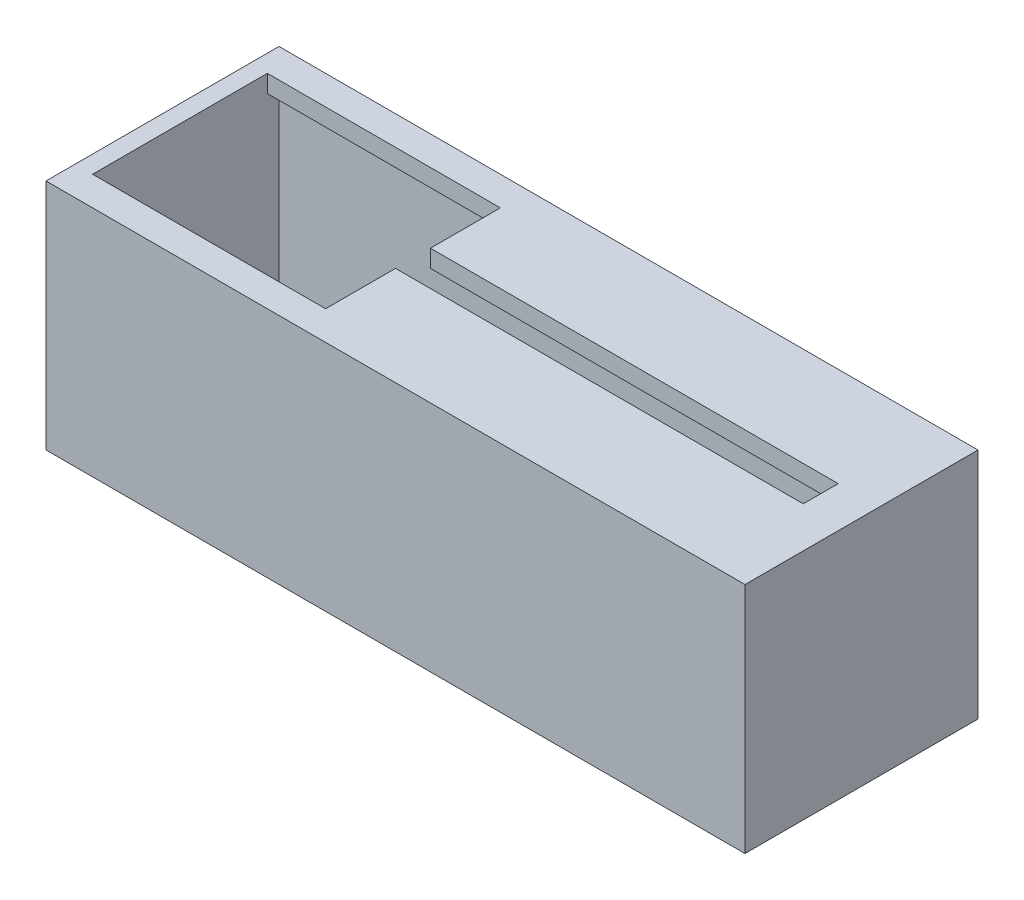
ISO-10303-21;
HEADER;
FILE_DESCRIPTION(('STEP AP214'),'2;1');
FILE_NAME('part.step','',(''),(''),'','','');
FILE_SCHEMA(('AUTOMOTIVE_DESIGN { 1 0 10303 214 1 1 1 1 }'));
ENDSEC;
DATA;
#1=APPLICATION_CONTEXT('core data for automotive mechanical design processes');
#2=APPLICATION_PROTOCOL_DEFINITION('international standard','automotive_design',2000,#1);
#3=PRODUCT_CONTEXT('',#1,'mechanical');
#4=PRODUCT('Part','Part','',(#3));
#5=PRODUCT_RELATED_PRODUCT_CATEGORY('part','',(#4));
#6=PRODUCT_DEFINITION_FORMATION('','',#4);
#7=PRODUCT_DEFINITION_CONTEXT('part definition',#1,'design');
#8=PRODUCT_DEFINITION('design','',#6,#7);
#9=PRODUCT_DEFINITION_SHAPE('','',#8);
#10=(LENGTH_UNIT() NAMED_UNIT(*) SI_UNIT(.MILLI.,.METRE.));
#11=(NAMED_UNIT(*) PLANE_ANGLE_UNIT() SI_UNIT($,.RADIAN.));
#12=(NAMED_UNIT(*) SI_UNIT($,.STERADIAN.) SOLID_ANGLE_UNIT());
#13=UNCERTAINTY_MEASURE_WITH_UNIT(LENGTH_MEASURE(1.E-05),#10,'distance_accuracy_value','');
#14=(GEOMETRIC_REPRESENTATION_CONTEXT(3) GLOBAL_UNCERTAINTY_ASSIGNED_CONTEXT((#13)) GLOBAL_UNIT_ASSIGNED_CONTEXT((#10,
#11,#12)) REPRESENTATION_CONTEXT('',''));
#15=CARTESIAN_POINT('',(0.,0.,0.));
#16=DIRECTION('',(0.,0.,1.));
#17=DIRECTION('',(1.,0.,0.));
#18=AXIS2_PLACEMENT_3D('',#15,#16,#17);
#19=CARTESIAN_POINT('',(1.5,20.,0.));
#20=DIRECTION('',(1.,0.,0.));
#21=DIRECTION('',(0.,0.,-1.));
#22=AXIS2_PLACEMENT_3D('',#19,#20,#21);
#23=PLANE('',#22);
#24=DIRECTION('',(0.,0.,1.));
#25=VECTOR('',#24,1.);
#26=CARTESIAN_POINT('',(1.5,18.5,0.));
#27=LINE('',#26,#25);
#28=CARTESIAN_POINT('',(1.5,18.5,1.5));
#29=VERTEX_POINT('',#28);
#30=CARTESIAN_POINT('',(1.5,18.5,2.5));
#31=VERTEX_POINT('',#30);
#32=EDGE_CURVE('E270',#29,#31,#27,.T.);
#33=ORIENTED_EDGE('',*,*,#32,.T.);
#34=DIRECTION('',(0.,1.,0.));
#35=VECTOR('',#34,1.);
#36=CARTESIAN_POINT('',(1.5,1.99999999999999,2.5));
#37=LINE('',#36,#35);
#38=CARTESIAN_POINT('',(1.5,20.,2.5));
#39=VERTEX_POINT('',#38);
#40=EDGE_CURVE('E198',#31,#39,#37,.T.);
#41=ORIENTED_EDGE('',*,*,#40,.T.);
#42=DIRECTION('',(0.,0.,1.));
#43=VECTOR('',#42,1.);
#44=CARTESIAN_POINT('',(1.5,20.,2.5));
#45=LINE('',#44,#43);
#46=CARTESIAN_POINT('',(1.5,20.,17.5));
#47=VERTEX_POINT('',#46);
#48=EDGE_CURVE('E55',#39,#47,#45,.T.);
#49=ORIENTED_EDGE('',*,*,#48,.T.);
#50=DIRECTION('',(0.,1.,0.));
#51=VECTOR('',#50,1.);
#52=CARTESIAN_POINT('',(1.5,1.99999999999999,17.5));
#53=LINE('',#52,#51);
#54=CARTESIAN_POINT('',(1.5,18.5,17.5));
#55=VERTEX_POINT('',#54);
#56=EDGE_CURVE('E163',#55,#47,#53,.T.);
#57=ORIENTED_EDGE('',*,*,#56,.F.);
#58=CARTESIAN_POINT('',(1.5,18.5,18.5));
#59=VERTEX_POINT('',#58);
#60=EDGE_CURVE('E274',#55,#59,#27,.T.);
#61=ORIENTED_EDGE('',*,*,#60,.T.);
#62=DIRECTION('',(0.,-1.,0.));
#63=VECTOR('',#62,1.);
#64=CARTESIAN_POINT('',(1.5,20.,18.5));
#65=LINE('',#64,#63);
#66=CARTESIAN_POINT('',(1.5,1.5,18.5));
#67=VERTEX_POINT('',#66);
#68=EDGE_CURVE('E289',#59,#67,#65,.T.);
#69=ORIENTED_EDGE('',*,*,#68,.T.);
#70=DIRECTION('',(0.,0.,1.));
#71=VECTOR('',#70,1.);
#72=CARTESIAN_POINT('',(1.5,1.5,0.));
#73=LINE('',#72,#71);
#74=CARTESIAN_POINT('',(1.5,1.5,1.5));
#75=VERTEX_POINT('',#74);
#76=EDGE_CURVE('E259',#75,#67,#73,.T.);
#77=ORIENTED_EDGE('',*,*,#76,.F.);
#78=DIRECTION('',(0.,-1.,0.));
#79=VECTOR('',#78,1.);
#80=CARTESIAN_POINT('',(1.5,20.,1.5));
#81=LINE('',#80,#79);
#82=EDGE_CURVE('E296',#29,#75,#81,.T.);
#83=ORIENTED_EDGE('',*,*,#82,.F.);
#84=EDGE_LOOP('',(#33,#41,#49,#57,#61,#69,#77,#83));
#85=FACE_BOUND('',#84,.T.);
#86=ADVANCED_FACE('F39',(#85),#23,.T.);
#87=CARTESIAN_POINT('',(0.,20.,18.5));
#88=DIRECTION('',(0.,0.,-1.));
#89=DIRECTION('',(-1.,0.,0.));
#90=AXIS2_PLACEMENT_3D('',#87,#88,#89);
#91=PLANE('',#90);
#92=DIRECTION('',(1.,0.,0.));
#93=VECTOR('',#92,1.);
#94=CARTESIAN_POINT('',(0.,1.5,18.5));
#95=LINE('',#94,#93);
#96=CARTESIAN_POINT('',(58.5,1.5,18.5));
#97=VERTEX_POINT('',#96);
#98=EDGE_CURVE('E293',#67,#97,#95,.T.);
#99=ORIENTED_EDGE('',*,*,#98,.F.);
#100=ORIENTED_EDGE('',*,*,#68,.F.);
#101=DIRECTION('',(1.,0.,0.));
#102=VECTOR('',#101,1.);
#103=CARTESIAN_POINT('',(0.,18.5,18.5));
#104=LINE('',#103,#102);
#105=CARTESIAN_POINT('',(58.5,18.5,18.5));
#106=VERTEX_POINT('',#105);
#107=EDGE_CURVE('E267',#59,#106,#104,.T.);
#108=ORIENTED_EDGE('',*,*,#107,.T.);
#109=DIRECTION('',(0.,-1.,0.));
#110=VECTOR('',#109,1.);
#111=CARTESIAN_POINT('',(58.5,20.,18.5));
#112=LINE('',#111,#110);
#113=EDGE_CURVE('E282',#106,#97,#112,.T.);
#114=ORIENTED_EDGE('',*,*,#113,.T.);
#115=EDGE_LOOP('',(#99,#100,#108,#114));
#116=FACE_BOUND('',#115,.T.);
#117=ADVANCED_FACE('F349',(#116),#91,.T.);
#118=CARTESIAN_POINT('',(58.5,20.,0.));
#119=DIRECTION('',(-1.,0.,0.));
#120=DIRECTION('',(0.,0.,1.));
#121=AXIS2_PLACEMENT_3D('',#118,#119,#120);
#122=PLANE('',#121);
#123=DIRECTION('',(0.,0.,-1.));
#124=VECTOR('',#123,1.);
#125=CARTESIAN_POINT('',(58.5,1.5,0.));
#126=LINE('',#125,#124);
#127=CARTESIAN_POINT('',(58.5,1.5,1.5));
#128=VERTEX_POINT('',#127);
#129=EDGE_CURVE('E286',#97,#128,#126,.T.);
#130=ORIENTED_EDGE('',*,*,#129,.F.);
#131=ORIENTED_EDGE('',*,*,#113,.F.);
#132=DIRECTION('',(0.,0.,-1.));
#133=VECTOR('',#132,1.);
#134=CARTESIAN_POINT('',(58.5,18.5,0.));
#135=LINE('',#134,#133);
#136=CARTESIAN_POINT('',(58.5,18.5,1.5));
#137=VERTEX_POINT('',#136);
#138=EDGE_CURVE('E264',#106,#137,#135,.T.);
#139=ORIENTED_EDGE('',*,*,#138,.T.);
#140=DIRECTION('',(0.,-1.,0.));
#141=VECTOR('',#140,1.);
#142=CARTESIAN_POINT('',(58.5,20.,1.5));
#143=LINE('',#142,#141);
#144=EDGE_CURVE('E275',#137,#128,#143,.T.);
#145=ORIENTED_EDGE('',*,*,#144,.T.);
#146=EDGE_LOOP('',(#130,#131,#139,#145));
#147=FACE_BOUND('',#146,.T.);
#148=ADVANCED_FACE('F346',(#147),#122,.T.);
#149=CARTESIAN_POINT('',(0.,20.,1.5));
#150=DIRECTION('',(0.,0.,1.));
#151=DIRECTION('',(1.,0.,0.));
#152=AXIS2_PLACEMENT_3D('',#149,#150,#151);
#153=PLANE('',#152);
#154=DIRECTION('',(-1.,0.,0.));
#155=VECTOR('',#154,1.);
#156=CARTESIAN_POINT('',(0.,1.5,1.5));
#157=LINE('',#156,#155);
#158=EDGE_CURVE('E279',#128,#75,#157,.T.);
#159=ORIENTED_EDGE('',*,*,#158,.F.);
#160=ORIENTED_EDGE('',*,*,#144,.F.);
#161=DIRECTION('',(-1.,0.,0.));
#162=VECTOR('',#161,1.);
#163=CARTESIAN_POINT('',(0.,18.5,1.5));
#164=LINE('',#163,#162);
#165=EDGE_CURVE('E260',#137,#29,#164,.T.);
#166=ORIENTED_EDGE('',*,*,#165,.T.);
#167=ORIENTED_EDGE('',*,*,#82,.T.);
#168=EDGE_LOOP('',(#159,#160,#166,#167));
#169=FACE_BOUND('',#168,.T.);
#170=ADVANCED_FACE('F343',(#169),#153,.T.);
#171=CARTESIAN_POINT('',(0.,18.5,0.));
#172=DIRECTION('',(0.,1.,0.));
#173=DIRECTION('',(0.,0.,1.));
#174=AXIS2_PLACEMENT_3D('',#171,#172,#173);
#175=PLANE('',#174);
#176=DIRECTION('',(0.,0.,-1.));
#177=VECTOR('',#176,1.);
#178=CARTESIAN_POINT('',(21.5,18.5,0.));
#179=LINE('',#178,#177);
#180=CARTESIAN_POINT('',(21.5,18.5,8.5));
#181=VERTEX_POINT('',#180);
#182=CARTESIAN_POINT('',(21.5,18.5,2.5));
#183=VERTEX_POINT('',#182);
#184=EDGE_CURVE('E48',#181,#183,#179,.T.);
#185=ORIENTED_EDGE('',*,*,#184,.T.);
#186=DIRECTION('',(-1.,0.,0.));
#187=VECTOR('',#186,1.);
#188=CARTESIAN_POINT('',(0.,18.5,2.5));
#189=LINE('',#188,#187);
#190=EDGE_CURVE('E11',#183,#31,#189,.T.);
#191=ORIENTED_EDGE('',*,*,#190,.T.);
#192=ORIENTED_EDGE('',*,*,#32,.F.);
#193=ORIENTED_EDGE('',*,*,#165,.F.);
#194=ORIENTED_EDGE('',*,*,#138,.F.);
#195=ORIENTED_EDGE('',*,*,#107,.F.);
#196=ORIENTED_EDGE('',*,*,#60,.F.);
#197=DIRECTION('',(1.,0.,0.));
#198=VECTOR('',#197,1.);
#199=CARTESIAN_POINT('',(0.,18.5,17.5));
#200=LINE('',#199,#198);
#201=CARTESIAN_POINT('',(21.5,18.5,17.5));
#202=VERTEX_POINT('',#201);
#203=EDGE_CURVE('E263',#55,#202,#200,.T.);
#204=ORIENTED_EDGE('',*,*,#203,.T.);
#205=DIRECTION('',(0.,0.,-1.));
#206=VECTOR('',#205,1.);
#207=CARTESIAN_POINT('',(21.5,18.5,0.));
#208=LINE('',#207,#206);
#209=CARTESIAN_POINT('',(21.5,18.5,11.5));
#210=VERTEX_POINT('',#209);
#211=EDGE_CURVE('E159',#202,#210,#208,.T.);
#212=ORIENTED_EDGE('',*,*,#211,.T.);
#213=DIRECTION('',(1.,0.,0.));
#214=VECTOR('',#213,1.);
#215=CARTESIAN_POINT('',(0.,18.5,11.5));
#216=LINE('',#215,#214);
#217=CARTESIAN_POINT('',(56.5,18.5,11.5));
#218=VERTEX_POINT('',#217);
#219=EDGE_CURVE('E307',#210,#218,#216,.T.);
#220=ORIENTED_EDGE('',*,*,#219,.T.);
#221=DIRECTION('',(0.,0.,-1.));
#222=VECTOR('',#221,1.);
#223=CARTESIAN_POINT('',(56.5,18.5,0.));
#224=LINE('',#223,#222);
#225=CARTESIAN_POINT('',(56.5,18.5,8.5));
#226=VERTEX_POINT('',#225);
#227=EDGE_CURVE('E311',#218,#226,#224,.T.);
#228=ORIENTED_EDGE('',*,*,#227,.T.);
#229=DIRECTION('',(-1.,0.,0.));
#230=VECTOR('',#229,1.);
#231=CARTESIAN_POINT('',(0.,18.5,8.5));
#232=LINE('',#231,#230);
#233=EDGE_CURVE('E315',#226,#181,#232,.T.);
#234=ORIENTED_EDGE('',*,*,#233,.T.);
#235=EDGE_LOOP('',(#185,#191,#192,#193,#194,#195,#196,#204,#212,#220,#228,#234));
#236=FACE_BOUND('',#235,.T.);
#237=ADVANCED_FACE('F321',(#236),#175,.F.);
#238=CARTESIAN_POINT('',(0.,1.5,0.));
#239=DIRECTION('',(0.,1.,0.));
#240=DIRECTION('',(0.,0.,1.));
#241=AXIS2_PLACEMENT_3D('',#238,#239,#240);
#242=PLANE('',#241);
#243=CARTESIAN_POINT('',(4.,1.5,10.25));
#244=DIRECTION('',(0.,1.,0.));
#245=DIRECTION('',(0.,0.,1.));
#246=AXIS2_PLACEMENT_3D('',#243,#244,#245);
#247=CIRCLE('',#246,1.25);
#248=CARTESIAN_POINT('',(4.,1.5,11.5));
#249=VERTEX_POINT('',#248);
#250=EDGE_CURVE('E549',#249,#249,#247,.T.);
#251=ORIENTED_EDGE('',*,*,#250,.F.);
#252=EDGE_LOOP('',(#251));
#253=FACE_BOUND('',#252,.T.);
#254=ORIENTED_EDGE('',*,*,#76,.T.);
#255=ORIENTED_EDGE('',*,*,#98,.T.);
#256=ORIENTED_EDGE('',*,*,#129,.T.);
#257=ORIENTED_EDGE('',*,*,#158,.T.);
#258=EDGE_LOOP('',(#254,#255,#256,#257));
#259=FACE_BOUND('',#258,.T.);
#260=ADVANCED_FACE('F41',(#253,#259),#242,.T.);
#261=CARTESIAN_POINT('',(1.5,1.99999999999999,2.5));
#262=DIRECTION('',(0.,0.,-1.));
#263=DIRECTION('',(-1.,0.,0.));
#264=AXIS2_PLACEMENT_3D('',#261,#262,#263);
#265=PLANE('',#264);
#266=DIRECTION('',(0.,1.,0.));
#267=VECTOR('',#266,1.);
#268=CARTESIAN_POINT('',(21.5,1.99999999999999,2.5));
#269=LINE('',#268,#267);
#270=CARTESIAN_POINT('',(21.5,20.,2.5));
#271=VERTEX_POINT('',#270);
#272=EDGE_CURVE('E202',#183,#271,#269,.T.);
#273=ORIENTED_EDGE('',*,*,#272,.T.);
#274=DIRECTION('',(-1.,0.,0.));
#275=VECTOR('',#274,1.);
#276=CARTESIAN_POINT('',(1.5,20.,2.5));
#277=LINE('',#276,#275);
#278=EDGE_CURVE('E194',#271,#39,#277,.T.);
#279=ORIENTED_EDGE('',*,*,#278,.T.);
#280=ORIENTED_EDGE('',*,*,#40,.F.);
#281=ORIENTED_EDGE('',*,*,#190,.F.);
#282=EDGE_LOOP('',(#273,#279,#280,#281));
#283=FACE_BOUND('',#282,.T.);
#284=ADVANCED_FACE('F334',(#283),#265,.F.);
#285=CARTESIAN_POINT('',(21.5,1.99999999999999,2.5));
#286=DIRECTION('',(1.,0.,0.));
#287=DIRECTION('',(0.,0.,-1.));
#288=AXIS2_PLACEMENT_3D('',#285,#286,#287);
#289=PLANE('',#288);
#290=DIRECTION('',(0.,1.,0.));
#291=VECTOR('',#290,1.);
#292=CARTESIAN_POINT('',(21.5,1.99999999999999,8.5));
#293=LINE('',#292,#291);
#294=CARTESIAN_POINT('',(21.5,20.,8.5));
#295=VERTEX_POINT('',#294);
#296=EDGE_CURVE('E205',#181,#295,#293,.T.);
#297=ORIENTED_EDGE('',*,*,#296,.T.);
#298=DIRECTION('',(0.,0.,-1.));
#299=VECTOR('',#298,1.);
#300=CARTESIAN_POINT('',(21.5,20.,2.5));
#301=LINE('',#300,#299);
#302=EDGE_CURVE('E190',#295,#271,#301,.T.);
#303=ORIENTED_EDGE('',*,*,#302,.T.);
#304=ORIENTED_EDGE('',*,*,#272,.F.);
#305=ORIENTED_EDGE('',*,*,#184,.F.);
#306=EDGE_LOOP('',(#297,#303,#304,#305));
#307=FACE_BOUND('',#306,.T.);
#308=ADVANCED_FACE('F326',(#307),#289,.F.);
#309=CARTESIAN_POINT('',(21.5,1.99999999999999,8.5));
#310=DIRECTION('',(0.,0.,-1.));
#311=DIRECTION('',(-1.,0.,0.));
#312=AXIS2_PLACEMENT_3D('',#309,#310,#311);
#313=PLANE('',#312);
#314=DIRECTION('',(0.,1.,0.));
#315=VECTOR('',#314,1.);
#316=CARTESIAN_POINT('',(56.5,1.99999999999999,8.5));
#317=LINE('',#316,#315);
#318=CARTESIAN_POINT('',(56.5,20.,8.5));
#319=VERTEX_POINT('',#318);
#320=EDGE_CURVE('E208',#226,#319,#317,.T.);
#321=ORIENTED_EDGE('',*,*,#320,.T.);
#322=DIRECTION('',(-1.,0.,0.));
#323=VECTOR('',#322,1.);
#324=CARTESIAN_POINT('',(21.5,20.,8.5));
#325=LINE('',#324,#323);
#326=EDGE_CURVE('E186',#319,#295,#325,.T.);
#327=ORIENTED_EDGE('',*,*,#326,.T.);
#328=ORIENTED_EDGE('',*,*,#296,.F.);
#329=ORIENTED_EDGE('',*,*,#233,.F.);
#330=EDGE_LOOP('',(#321,#327,#328,#329));
#331=FACE_BOUND('',#330,.T.);
#332=ADVANCED_FACE('F328',(#331),#313,.F.);
#333=CARTESIAN_POINT('',(56.5,1.99999999999999,8.5));
#334=DIRECTION('',(1.,0.,0.));
#335=DIRECTION('',(0.,0.,-1.));
#336=AXIS2_PLACEMENT_3D('',#333,#334,#335);
#337=PLANE('',#336);
#338=DIRECTION('',(0.,1.,0.));
#339=VECTOR('',#338,1.);
#340=CARTESIAN_POINT('',(56.5,1.99999999999999,11.5));
#341=LINE('',#340,#339);
#342=CARTESIAN_POINT('',(56.5,20.,11.5));
#343=VERTEX_POINT('',#342);
#344=EDGE_CURVE('E211',#218,#343,#341,.T.);
#345=ORIENTED_EDGE('',*,*,#344,.T.);
#346=DIRECTION('',(0.,0.,-1.));
#347=VECTOR('',#346,1.);
#348=CARTESIAN_POINT('',(56.5,20.,8.5));
#349=LINE('',#348,#347);
#350=EDGE_CURVE('E179',#343,#319,#349,.T.);
#351=ORIENTED_EDGE('',*,*,#350,.T.);
#352=ORIENTED_EDGE('',*,*,#320,.F.);
#353=ORIENTED_EDGE('',*,*,#227,.F.);
#354=EDGE_LOOP('',(#345,#351,#352,#353));
#355=FACE_BOUND('',#354,.T.);
#356=ADVANCED_FACE('F409',(#355),#337,.F.);
#357=CARTESIAN_POINT('',(21.5,1.99999999999999,11.5));
#358=DIRECTION('',(0.,0.,1.));
#359=DIRECTION('',(1.,0.,0.));
#360=AXIS2_PLACEMENT_3D('',#357,#358,#359);
#361=PLANE('',#360);
#362=DIRECTION('',(0.,1.,0.));
#363=VECTOR('',#362,1.);
#364=CARTESIAN_POINT('',(21.5,1.99999999999999,11.5));
#365=LINE('',#364,#363);
#366=CARTESIAN_POINT('',(21.5,20.,11.5));
#367=VERTEX_POINT('',#366);
#368=EDGE_CURVE('E162',#210,#367,#365,.T.);
#369=ORIENTED_EDGE('',*,*,#368,.T.);
#370=DIRECTION('',(1.,0.,0.));
#371=VECTOR('',#370,1.);
#372=CARTESIAN_POINT('',(21.5,20.,11.5));
#373=LINE('',#372,#371);
#374=EDGE_CURVE('E175',#367,#343,#373,.T.);
#375=ORIENTED_EDGE('',*,*,#374,.T.);
#376=ORIENTED_EDGE('',*,*,#344,.F.);
#377=ORIENTED_EDGE('',*,*,#219,.F.);
#378=EDGE_LOOP('',(#369,#375,#376,#377));
#379=FACE_BOUND('',#378,.T.);
#380=ADVANCED_FACE('F418',(#379),#361,.F.);
#381=CARTESIAN_POINT('',(21.5,1.99999999999999,11.5));
#382=DIRECTION('',(1.,0.,0.));
#383=DIRECTION('',(0.,0.,-1.));
#384=AXIS2_PLACEMENT_3D('',#381,#382,#383);
#385=PLANE('',#384);
#386=DIRECTION('',(0.,1.,0.));
#387=VECTOR('',#386,1.);
#388=CARTESIAN_POINT('',(21.5,1.99999999999999,17.5));
#389=LINE('',#388,#387);
#390=CARTESIAN_POINT('',(21.5,20.,17.5));
#391=VERTEX_POINT('',#390);
#392=EDGE_CURVE('E63',#202,#391,#389,.T.);
#393=ORIENTED_EDGE('',*,*,#392,.T.);
#394=DIRECTION('',(0.,0.,-1.));
#395=VECTOR('',#394,1.);
#396=CARTESIAN_POINT('',(21.5,20.,11.5));
#397=LINE('',#396,#395);
#398=EDGE_CURVE('E156',#391,#367,#397,.T.);
#399=ORIENTED_EDGE('',*,*,#398,.T.);
#400=ORIENTED_EDGE('',*,*,#368,.F.);
#401=ORIENTED_EDGE('',*,*,#211,.F.);
#402=EDGE_LOOP('',(#393,#399,#400,#401));
#403=FACE_BOUND('',#402,.T.);
#404=ADVANCED_FACE('F153',(#403),#385,.F.);
#405=CARTESIAN_POINT('',(1.5,1.99999999999999,17.5));
#406=DIRECTION('',(0.,0.,1.));
#407=DIRECTION('',(1.,0.,0.));
#408=AXIS2_PLACEMENT_3D('',#405,#406,#407);
#409=PLANE('',#408);
#410=ORIENTED_EDGE('',*,*,#56,.T.);
#411=DIRECTION('',(1.,0.,0.));
#412=VECTOR('',#411,1.);
#413=CARTESIAN_POINT('',(1.5,20.,17.5));
#414=LINE('',#413,#412);
#415=EDGE_CURVE('E166',#47,#391,#414,.T.);
#416=ORIENTED_EDGE('',*,*,#415,.T.);
#417=ORIENTED_EDGE('',*,*,#392,.F.);
#418=ORIENTED_EDGE('',*,*,#203,.F.);
#419=EDGE_LOOP('',(#410,#416,#417,#418));
#420=FACE_BOUND('',#419,.T.);
#421=ADVANCED_FACE('F167',(#420),#409,.F.);
#422=CARTESIAN_POINT('',(0.,20.,0.));
#423=DIRECTION('',(1.,0.,0.));
#424=DIRECTION('',(0.,0.,-1.));
#425=AXIS2_PLACEMENT_3D('',#422,#423,#424);
#426=PLANE('',#425);
#427=DIRECTION('',(0.,0.,1.));
#428=VECTOR('',#427,1.);
#429=CARTESIAN_POINT('',(0.,0.,0.));
#430=LINE('',#429,#428);
#431=CARTESIAN_POINT('',(0.,0.,0.));
#432=VERTEX_POINT('',#431);
#433=CARTESIAN_POINT('',(0.,0.,20.));
#434=VERTEX_POINT('',#433);
#435=EDGE_CURVE('E201',#432,#434,#430,.T.);
#436=ORIENTED_EDGE('',*,*,#435,.T.);
#437=DIRECTION('',(0.,-1.,0.));
#438=VECTOR('',#437,1.);
#439=CARTESIAN_POINT('',(0.,20.,20.));
#440=LINE('',#439,#438);
#441=CARTESIAN_POINT('',(0.,20.,20.));
#442=VERTEX_POINT('',#441);
#443=EDGE_CURVE('E255',#442,#434,#440,.T.);
#444=ORIENTED_EDGE('',*,*,#443,.F.);
#445=DIRECTION('',(0.,0.,1.));
#446=VECTOR('',#445,1.);
#447=CARTESIAN_POINT('',(0.,20.,0.));
#448=LINE('',#447,#446);
#449=CARTESIAN_POINT('',(0.,20.,0.));
#450=VERTEX_POINT('',#449);
#451=EDGE_CURVE('E218',#450,#442,#448,.T.);
#452=ORIENTED_EDGE('',*,*,#451,.F.);
#453=DIRECTION('',(0.,-1.,0.));
#454=VECTOR('',#453,1.);
#455=CARTESIAN_POINT('',(0.,20.,0.));
#456=LINE('',#455,#454);
#457=EDGE_CURVE('E232',#450,#432,#456,.T.);
#458=ORIENTED_EDGE('',*,*,#457,.T.);
#459=EDGE_LOOP('',(#436,#444,#452,#458));
#460=FACE_BOUND('',#459,.T.);
#461=ADVANCED_FACE('F369',(#460),#426,.F.);
#462=CARTESIAN_POINT('',(0.,20.,20.));
#463=DIRECTION('',(0.,0.,-1.));
#464=DIRECTION('',(-1.,0.,0.));
#465=AXIS2_PLACEMENT_3D('',#462,#463,#464);
#466=PLANE('',#465);
#467=DIRECTION('',(1.,0.,0.));
#468=VECTOR('',#467,1.);
#469=CARTESIAN_POINT('',(0.,0.,20.));
#470=LINE('',#469,#468);
#471=CARTESIAN_POINT('',(60.,0.,20.));
#472=VERTEX_POINT('',#471);
#473=EDGE_CURVE('E236',#434,#472,#470,.T.);
#474=ORIENTED_EDGE('',*,*,#473,.T.);
#475=DIRECTION('',(0.,-1.,0.));
#476=VECTOR('',#475,1.);
#477=CARTESIAN_POINT('',(60.,20.,20.));
#478=LINE('',#477,#476);
#479=CARTESIAN_POINT('',(60.,20.,20.));
#480=VERTEX_POINT('',#479);
#481=EDGE_CURVE('E251',#480,#472,#478,.T.);
#482=ORIENTED_EDGE('',*,*,#481,.F.);
#483=DIRECTION('',(1.,0.,0.));
#484=VECTOR('',#483,1.);
#485=CARTESIAN_POINT('',(0.,20.,20.));
#486=LINE('',#485,#484);
#487=EDGE_CURVE('E222',#442,#480,#486,.T.);
#488=ORIENTED_EDGE('',*,*,#487,.F.);
#489=ORIENTED_EDGE('',*,*,#443,.T.);
#490=EDGE_LOOP('',(#474,#482,#488,#489));
#491=FACE_BOUND('',#490,.T.);
#492=ADVANCED_FACE('F491',(#491),#466,.F.);
#493=CARTESIAN_POINT('',(60.,20.,0.));
#494=DIRECTION('',(-1.,0.,0.));
#495=DIRECTION('',(0.,0.,1.));
#496=AXIS2_PLACEMENT_3D('',#493,#494,#495);
#497=PLANE('',#496);
#498=DIRECTION('',(0.,0.,-1.));
#499=VECTOR('',#498,1.);
#500=CARTESIAN_POINT('',(60.,0.,0.));
#501=LINE('',#500,#499);
#502=CARTESIAN_POINT('',(60.,0.,0.));
#503=VERTEX_POINT('',#502);
#504=EDGE_CURVE('E239',#472,#503,#501,.T.);
#505=ORIENTED_EDGE('',*,*,#504,.T.);
#506=DIRECTION('',(0.,-1.,0.));
#507=VECTOR('',#506,1.);
#508=CARTESIAN_POINT('',(60.,20.,0.));
#509=LINE('',#508,#507);
#510=CARTESIAN_POINT('',(60.,20.,0.));
#511=VERTEX_POINT('',#510);
#512=EDGE_CURVE('E247',#511,#503,#509,.T.);
#513=ORIENTED_EDGE('',*,*,#512,.F.);
#514=DIRECTION('',(0.,0.,-1.));
#515=VECTOR('',#514,1.);
#516=CARTESIAN_POINT('',(60.,20.,0.));
#517=LINE('',#516,#515);
#518=EDGE_CURVE('E226',#480,#511,#517,.T.);
#519=ORIENTED_EDGE('',*,*,#518,.F.);
#520=ORIENTED_EDGE('',*,*,#481,.T.);
#521=EDGE_LOOP('',(#505,#513,#519,#520));
#522=FACE_BOUND('',#521,.T.);
#523=ADVANCED_FACE('F488',(#522),#497,.F.);
#524=CARTESIAN_POINT('',(0.,20.,0.));
#525=DIRECTION('',(0.,0.,1.));
#526=DIRECTION('',(1.,0.,0.));
#527=AXIS2_PLACEMENT_3D('',#524,#525,#526);
#528=PLANE('',#527);
#529=DIRECTION('',(-1.,0.,0.));
#530=VECTOR('',#529,1.);
#531=CARTESIAN_POINT('',(0.,0.,0.));
#532=LINE('',#531,#530);
#533=EDGE_CURVE('E223',#503,#432,#532,.T.);
#534=ORIENTED_EDGE('',*,*,#533,.T.);
#535=ORIENTED_EDGE('',*,*,#457,.F.);
#536=DIRECTION('',(-1.,0.,0.));
#537=VECTOR('',#536,1.);
#538=CARTESIAN_POINT('',(0.,20.,0.));
#539=LINE('',#538,#537);
#540=EDGE_CURVE('E229',#511,#450,#539,.T.);
#541=ORIENTED_EDGE('',*,*,#540,.F.);
#542=ORIENTED_EDGE('',*,*,#512,.T.);
#543=EDGE_LOOP('',(#534,#535,#541,#542));
#544=FACE_BOUND('',#543,.T.);
#545=ADVANCED_FACE('F455',(#544),#528,.F.);
#546=CARTESIAN_POINT('',(0.,20.,0.));
#547=DIRECTION('',(0.,1.,0.));
#548=DIRECTION('',(0.,0.,1.));
#549=AXIS2_PLACEMENT_3D('',#546,#547,#548);
#550=PLANE('',#549);
#551=ORIENTED_EDGE('',*,*,#48,.F.);
#552=ORIENTED_EDGE('',*,*,#278,.F.);
#553=ORIENTED_EDGE('',*,*,#302,.F.);
#554=ORIENTED_EDGE('',*,*,#326,.F.);
#555=ORIENTED_EDGE('',*,*,#350,.F.);
#556=ORIENTED_EDGE('',*,*,#374,.F.);
#557=ORIENTED_EDGE('',*,*,#398,.F.);
#558=ORIENTED_EDGE('',*,*,#415,.F.);
#559=EDGE_LOOP('',(#551,#552,#553,#554,#555,#556,#557,#558));
#560=FACE_BOUND('',#559,.T.);
#561=ORIENTED_EDGE('',*,*,#451,.T.);
#562=ORIENTED_EDGE('',*,*,#487,.T.);
#563=ORIENTED_EDGE('',*,*,#518,.T.);
#564=ORIENTED_EDGE('',*,*,#540,.T.);
#565=EDGE_LOOP('',(#561,#562,#563,#564));
#566=FACE_BOUND('',#565,.T.);
#567=ADVANCED_FACE('F171',(#560,#566),#550,.T.);
#568=CARTESIAN_POINT('',(0.,0.,0.));
#569=DIRECTION('',(0.,1.,0.));
#570=DIRECTION('',(0.,0.,1.));
#571=AXIS2_PLACEMENT_3D('',#568,#569,#570);
#572=PLANE('',#571);
#573=CARTESIAN_POINT('',(4.,0.,10.25));
#574=DIRECTION('',(0.,1.,0.));
#575=DIRECTION('',(0.,0.,1.));
#576=AXIS2_PLACEMENT_3D('',#573,#574,#575);
#577=CIRCLE('',#576,1.25);
#578=CARTESIAN_POINT('',(4.,0.,11.5));
#579=VERTEX_POINT('',#578);
#580=EDGE_CURVE('E547',#579,#579,#577,.T.);
#581=ORIENTED_EDGE('',*,*,#580,.T.);
#582=EDGE_LOOP('',(#581));
#583=FACE_BOUND('',#582,.T.);
#584=ORIENTED_EDGE('',*,*,#435,.F.);
#585=ORIENTED_EDGE('',*,*,#533,.F.);
#586=ORIENTED_EDGE('',*,*,#504,.F.);
#587=ORIENTED_EDGE('',*,*,#473,.F.);
#588=EDGE_LOOP('',(#584,#585,#586,#587));
#589=FACE_BOUND('',#588,.T.);
#590=ADVANCED_FACE('F454',(#583,#589),#572,.F.);
#591=CARTESIAN_POINT('',(4.,0.,10.25));
#592=DIRECTION('',(0.,1.,0.));
#593=DIRECTION('',(0.,0.,1.));
#594=AXIS2_PLACEMENT_3D('',#591,#592,#593);
#595=CYLINDRICAL_SURFACE('',#594,1.25);
#596=ORIENTED_EDGE('',*,*,#580,.F.);
#597=EDGE_LOOP('',(#596));
#598=FACE_BOUND('',#597,.T.);
#599=ORIENTED_EDGE('',*,*,#250,.T.);
#600=EDGE_LOOP('',(#599));
#601=FACE_BOUND('',#600,.T.);
#602=ADVANCED_FACE('F470',(#598,#601),#595,.F.);
#603=CLOSED_SHELL('',(#86,#117,#148,#170,#237,#260,#284,#308,#332,#356,#380,#404,#421,#461,#492,
#523,#545,#567,#590,#602));
#604=MANIFOLD_SOLID_BREP('B2',#603);
#605=ADVANCED_BREP_SHAPE_REPRESENTATION('',(#18,#604),#14);
#606=SHAPE_DEFINITION_REPRESENTATION(#9,#605);
ENDSEC;
END-ISO-10303-21;
